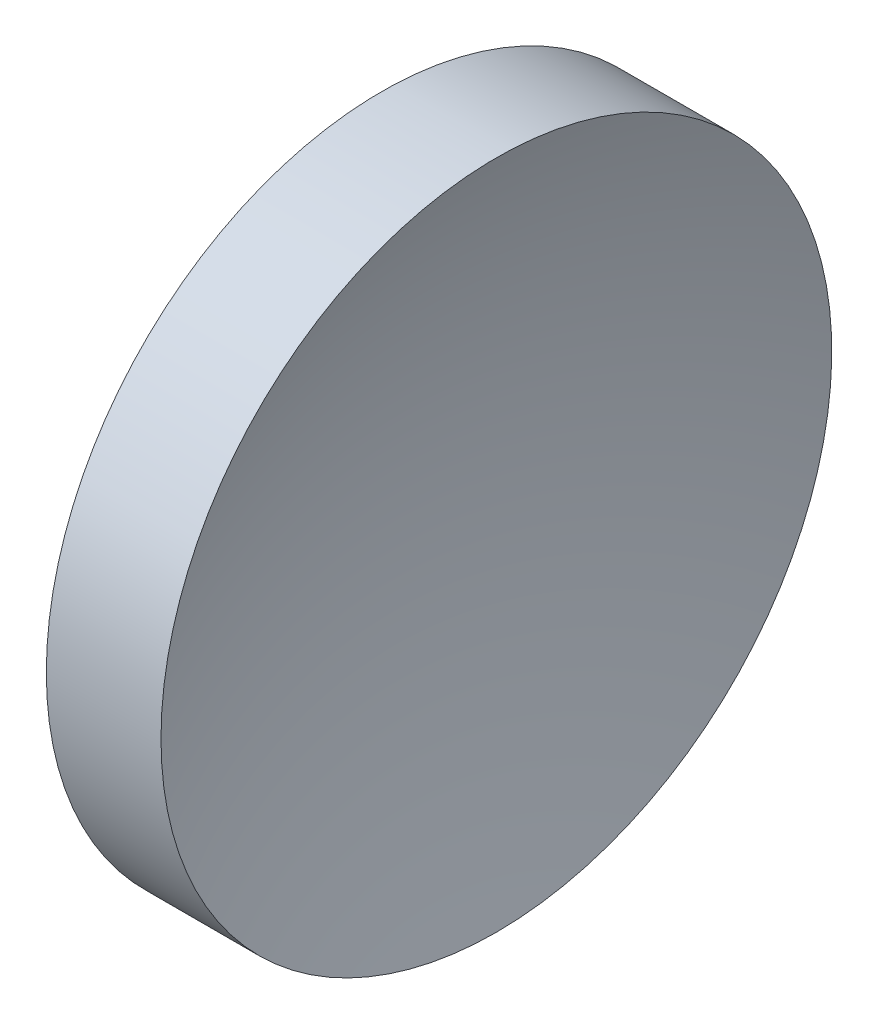
ISO-10303-21;
HEADER;
FILE_DESCRIPTION(('STEP AP214'),'2;1');
FILE_NAME('part.step','',(''),(''),'','','');
FILE_SCHEMA(('AUTOMOTIVE_DESIGN { 1 0 10303 214 1 1 1 1 }'));
ENDSEC;
DATA;
#1=APPLICATION_CONTEXT('core data for automotive mechanical design processes');
#2=APPLICATION_PROTOCOL_DEFINITION('international standard','automotive_design',2000,#1);
#3=PRODUCT_CONTEXT('',#1,'mechanical');
#4=PRODUCT('Part','Part','',(#3));
#5=PRODUCT_RELATED_PRODUCT_CATEGORY('part','',(#4));
#6=PRODUCT_DEFINITION_FORMATION('','',#4);
#7=PRODUCT_DEFINITION_CONTEXT('part definition',#1,'design');
#8=PRODUCT_DEFINITION('design','',#6,#7);
#9=PRODUCT_DEFINITION_SHAPE('','',#8);
#10=(LENGTH_UNIT() NAMED_UNIT(*) SI_UNIT(.MILLI.,.METRE.));
#11=(NAMED_UNIT(*) PLANE_ANGLE_UNIT() SI_UNIT($,.RADIAN.));
#12=(NAMED_UNIT(*) SI_UNIT($,.STERADIAN.) SOLID_ANGLE_UNIT());
#13=UNCERTAINTY_MEASURE_WITH_UNIT(LENGTH_MEASURE(1.E-05),#10,'distance_accuracy_value','');
#14=(GEOMETRIC_REPRESENTATION_CONTEXT(3) GLOBAL_UNCERTAINTY_ASSIGNED_CONTEXT((#13)) GLOBAL_UNIT_ASSIGNED_CONTEXT((#10,
#11,#12)) REPRESENTATION_CONTEXT('',''));
#15=CARTESIAN_POINT('',(0.,0.,0.));
#16=DIRECTION('',(0.,0.,1.));
#17=DIRECTION('',(1.,0.,0.));
#18=AXIS2_PLACEMENT_3D('',#15,#16,#17);
#19=CARTESIAN_POINT('',(157.106834178548,71.1939890865937,0.));
#20=DIRECTION('',(-1.,0.,0.));
#21=DIRECTION('',(0.,-1.,0.));
#22=AXIS2_PLACEMENT_3D('',#19,#20,#21);
#23=SPHERICAL_SURFACE('',#22,35.6);
#24=CARTESIAN_POINT('',(123.849203475204,71.1939890865937,0.));
#25=DIRECTION('',(-1.,0.,0.));
#26=DIRECTION('',(0.,0.,1.));
#27=AXIS2_PLACEMENT_3D('',#24,#25,#26);
#28=CIRCLE('',#27,12.7);
#29=CARTESIAN_POINT('',(123.849203475204,71.1939890865937,12.7));
#30=VERTEX_POINT('',#29);
#31=EDGE_CURVE('E10',#30,#30,#28,.T.);
#32=ORIENTED_EDGE('',*,*,#31,.F.);
#33=EDGE_LOOP('',(#32));
#34=FACE_BOUND('',#33,.T.);
#35=ADVANCED_FACE('F35',(#34),#23,.F.);
#36=CARTESIAN_POINT('',(111.955229757561,71.1939890865937,0.));
#37=DIRECTION('',(-1.,0.,0.));
#38=DIRECTION('',(0.,0.,1.));
#39=AXIS2_PLACEMENT_3D('',#36,#37,#38);
#40=CYLINDRICAL_SURFACE('',#39,12.7);
#41=CARTESIAN_POINT('',(119.506834178548,71.1939890865937,0.));
#42=DIRECTION('',(-1.,0.,0.));
#43=DIRECTION('',(0.,0.,1.));
#44=AXIS2_PLACEMENT_3D('',#41,#42,#43);
#45=CIRCLE('',#44,12.7);
#46=CARTESIAN_POINT('',(119.506834178548,71.1939890865937,12.7));
#47=VERTEX_POINT('',#46);
#48=EDGE_CURVE('E41',#47,#47,#45,.T.);
#49=ORIENTED_EDGE('',*,*,#48,.F.);
#50=EDGE_LOOP('',(#49));
#51=FACE_BOUND('',#50,.T.);
#52=ORIENTED_EDGE('',*,*,#31,.T.);
#53=EDGE_LOOP('',(#52));
#54=FACE_BOUND('',#53,.T.);
#55=ADVANCED_FACE('F49',(#51,#54),#40,.T.);
#56=CARTESIAN_POINT('',(119.506834178548,71.1939890865937,0.));
#57=DIRECTION('',(1.,0.,0.));
#58=DIRECTION('',(0.,0.,-1.));
#59=AXIS2_PLACEMENT_3D('',#56,#57,#58);
#60=PLANE('',#59);
#61=ORIENTED_EDGE('',*,*,#48,.T.);
#62=EDGE_LOOP('',(#61));
#63=FACE_BOUND('',#62,.T.);
#64=ADVANCED_FACE('F47',(#63),#60,.F.);
#65=CLOSED_SHELL('',(#35,#55,#64));
#66=MANIFOLD_SOLID_BREP('B2',#65);
#67=ADVANCED_BREP_SHAPE_REPRESENTATION('',(#18,#66),#14);
#68=SHAPE_DEFINITION_REPRESENTATION(#9,#67);
ENDSEC;
END-ISO-10303-21;
